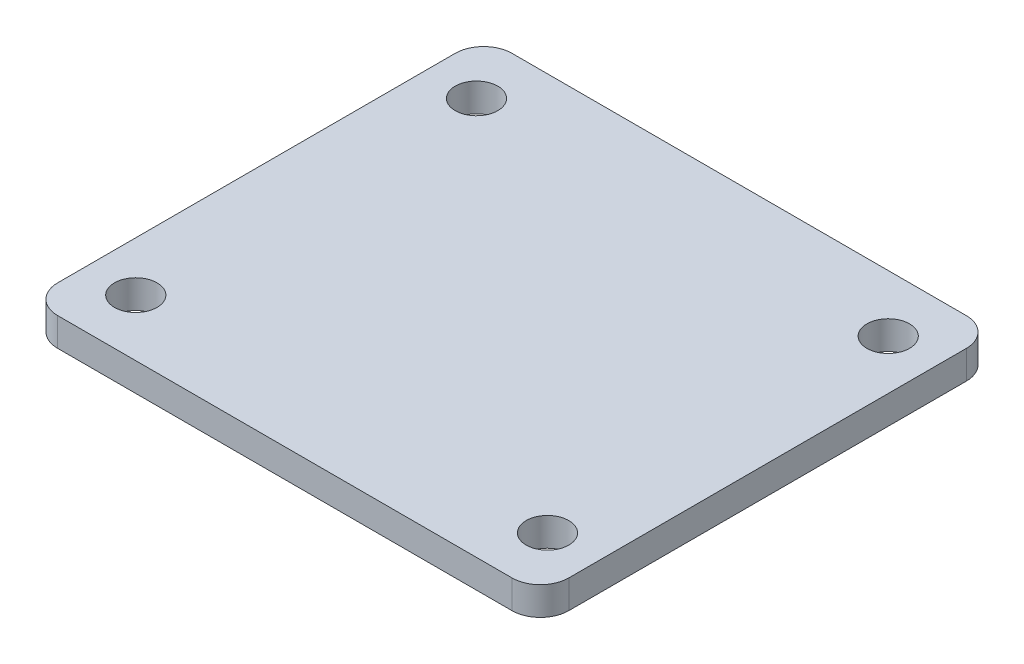
ISO-10303-21;
HEADER;
FILE_DESCRIPTION(('STEP AP214'),'2;1');
FILE_NAME('part.step','',(''),(''),'','','');
FILE_SCHEMA(('AUTOMOTIVE_DESIGN { 1 0 10303 214 1 1 1 1 }'));
ENDSEC;
DATA;
#1=APPLICATION_CONTEXT('core data for automotive mechanical design processes');
#2=APPLICATION_PROTOCOL_DEFINITION('international standard','automotive_design',2000,#1);
#3=PRODUCT_CONTEXT('',#1,'mechanical');
#4=PRODUCT('Part','Part','',(#3));
#5=PRODUCT_RELATED_PRODUCT_CATEGORY('part','',(#4));
#6=PRODUCT_DEFINITION_FORMATION('','',#4);
#7=PRODUCT_DEFINITION_CONTEXT('part definition',#1,'design');
#8=PRODUCT_DEFINITION('design','',#6,#7);
#9=PRODUCT_DEFINITION_SHAPE('','',#8);
#10=(LENGTH_UNIT() NAMED_UNIT(*) SI_UNIT(.MILLI.,.METRE.));
#11=(NAMED_UNIT(*) PLANE_ANGLE_UNIT() SI_UNIT($,.RADIAN.));
#12=(NAMED_UNIT(*) SI_UNIT($,.STERADIAN.) SOLID_ANGLE_UNIT());
#13=UNCERTAINTY_MEASURE_WITH_UNIT(LENGTH_MEASURE(1.E-05),#10,'distance_accuracy_value','');
#14=(GEOMETRIC_REPRESENTATION_CONTEXT(3) GLOBAL_UNCERTAINTY_ASSIGNED_CONTEXT((#13)) GLOBAL_UNIT_ASSIGNED_CONTEXT((#10,
#11,#12)) REPRESENTATION_CONTEXT('',''));
#15=CARTESIAN_POINT('',(0.,0.,0.));
#16=DIRECTION('',(0.,0.,1.));
#17=DIRECTION('',(1.,0.,0.));
#18=AXIS2_PLACEMENT_3D('',#15,#16,#17);
#19=CARTESIAN_POINT('',(-57.15,6.35,-50.8));
#20=DIRECTION('',(1.,0.,0.));
#21=DIRECTION('',(0.,0.,-1.));
#22=AXIS2_PLACEMENT_3D('',#19,#20,#21);
#23=PLANE('',#22);
#24=DIRECTION('',(0.,0.,1.));
#25=VECTOR('',#24,1.);
#26=CARTESIAN_POINT('',(-57.15,6.35,-50.8));
#27=LINE('',#26,#25);
#28=CARTESIAN_POINT('',(-57.15,6.35,-44.45));
#29=VERTEX_POINT('',#28);
#30=CARTESIAN_POINT('',(-57.15,6.35,44.45));
#31=VERTEX_POINT('',#30);
#32=EDGE_CURVE('E129',#29,#31,#27,.T.);
#33=ORIENTED_EDGE('',*,*,#32,.F.);
#34=DIRECTION('',(0.,-1.,0.));
#35=VECTOR('',#34,1.);
#36=CARTESIAN_POINT('',(-57.15,6.35,-44.45));
#37=LINE('',#36,#35);
#38=CARTESIAN_POINT('',(-57.15,0.,-44.45));
#39=VERTEX_POINT('',#38);
#40=EDGE_CURVE('E155',#29,#39,#37,.T.);
#41=ORIENTED_EDGE('',*,*,#40,.T.);
#42=DIRECTION('',(0.,0.,1.));
#43=VECTOR('',#42,1.);
#44=CARTESIAN_POINT('',(-57.15,0.,-50.8));
#45=LINE('',#44,#43);
#46=CARTESIAN_POINT('',(-57.15,0.,44.45));
#47=VERTEX_POINT('',#46);
#48=EDGE_CURVE('E161',#39,#47,#45,.T.);
#49=ORIENTED_EDGE('',*,*,#48,.T.);
#50=DIRECTION('',(0.,-1.,0.));
#51=VECTOR('',#50,1.);
#52=CARTESIAN_POINT('',(-57.15,6.35,44.45));
#53=LINE('',#52,#51);
#54=EDGE_CURVE('E153',#47,#31,#53,.F.);
#55=ORIENTED_EDGE('',*,*,#54,.T.);
#56=EDGE_LOOP('',(#33,#41,#49,#55));
#57=FACE_BOUND('',#56,.T.);
#58=ADVANCED_FACE('F37',(#57),#23,.F.);
#59=CARTESIAN_POINT('',(57.15,6.35,50.8));
#60=DIRECTION('',(0.,0.,-1.));
#61=DIRECTION('',(-1.,0.,0.));
#62=AXIS2_PLACEMENT_3D('',#59,#60,#61);
#63=PLANE('',#62);
#64=DIRECTION('',(1.,0.,0.));
#65=VECTOR('',#64,1.);
#66=CARTESIAN_POINT('',(57.15,6.35,50.8));
#67=LINE('',#66,#65);
#68=CARTESIAN_POINT('',(-50.8,6.35,50.8));
#69=VERTEX_POINT('',#68);
#70=CARTESIAN_POINT('',(50.8,6.35,50.8));
#71=VERTEX_POINT('',#70);
#72=EDGE_CURVE('E132',#69,#71,#67,.T.);
#73=ORIENTED_EDGE('',*,*,#72,.F.);
#74=DIRECTION('',(0.,-1.,0.));
#75=VECTOR('',#74,1.);
#76=CARTESIAN_POINT('',(-50.8,6.35,50.8));
#77=LINE('',#76,#75);
#78=CARTESIAN_POINT('',(-50.8,0.,50.8));
#79=VERTEX_POINT('',#78);
#80=EDGE_CURVE('E11',#69,#79,#77,.T.);
#81=ORIENTED_EDGE('',*,*,#80,.T.);
#82=DIRECTION('',(1.,0.,0.));
#83=VECTOR('',#82,1.);
#84=CARTESIAN_POINT('',(57.15,0.,50.8));
#85=LINE('',#84,#83);
#86=CARTESIAN_POINT('',(50.8,0.,50.8));
#87=VERTEX_POINT('',#86);
#88=EDGE_CURVE('E134',#79,#87,#85,.T.);
#89=ORIENTED_EDGE('',*,*,#88,.T.);
#90=DIRECTION('',(0.,-1.,0.));
#91=VECTOR('',#90,1.);
#92=CARTESIAN_POINT('',(50.8,6.35,50.8));
#93=LINE('',#92,#91);
#94=EDGE_CURVE('E45',#87,#71,#93,.F.);
#95=ORIENTED_EDGE('',*,*,#94,.T.);
#96=EDGE_LOOP('',(#73,#81,#89,#95));
#97=FACE_BOUND('',#96,.T.);
#98=ADVANCED_FACE('F215',(#97),#63,.F.);
#99=CARTESIAN_POINT('',(57.15,6.35,-50.8));
#100=DIRECTION('',(-1.,0.,0.));
#101=DIRECTION('',(0.,0.,1.));
#102=AXIS2_PLACEMENT_3D('',#99,#100,#101);
#103=PLANE('',#102);
#104=DIRECTION('',(0.,0.,-1.));
#105=VECTOR('',#104,1.);
#106=CARTESIAN_POINT('',(57.15,0.,-50.8));
#107=LINE('',#106,#105);
#108=CARTESIAN_POINT('',(57.15,0.,44.45));
#109=VERTEX_POINT('',#108);
#110=CARTESIAN_POINT('',(57.15,0.,-44.45));
#111=VERTEX_POINT('',#110);
#112=EDGE_CURVE('E130',#109,#111,#107,.T.);
#113=ORIENTED_EDGE('',*,*,#112,.T.);
#114=DIRECTION('',(0.,-1.,0.));
#115=VECTOR('',#114,1.);
#116=CARTESIAN_POINT('',(57.15,6.35,-44.45));
#117=LINE('',#116,#115);
#118=CARTESIAN_POINT('',(57.15,6.35,-44.45));
#119=VERTEX_POINT('',#118);
#120=EDGE_CURVE('E108',#111,#119,#117,.F.);
#121=ORIENTED_EDGE('',*,*,#120,.T.);
#122=DIRECTION('',(0.,0.,-1.));
#123=VECTOR('',#122,1.);
#124=CARTESIAN_POINT('',(57.15,6.35,-50.8));
#125=LINE('',#124,#123);
#126=CARTESIAN_POINT('',(57.15,6.35,44.45));
#127=VERTEX_POINT('',#126);
#128=EDGE_CURVE('E173',#127,#119,#125,.T.);
#129=ORIENTED_EDGE('',*,*,#128,.F.);
#130=DIRECTION('',(0.,-1.,0.));
#131=VECTOR('',#130,1.);
#132=CARTESIAN_POINT('',(57.15,6.35,44.45));
#133=LINE('',#132,#131);
#134=EDGE_CURVE('E113',#127,#109,#133,.T.);
#135=ORIENTED_EDGE('',*,*,#134,.T.);
#136=EDGE_LOOP('',(#113,#121,#129,#135));
#137=FACE_BOUND('',#136,.T.);
#138=ADVANCED_FACE('F213',(#137),#103,.F.);
#139=CARTESIAN_POINT('',(57.15,6.35,-50.8));
#140=DIRECTION('',(0.,0.,1.));
#141=DIRECTION('',(1.,0.,0.));
#142=AXIS2_PLACEMENT_3D('',#139,#140,#141);
#143=PLANE('',#142);
#144=DIRECTION('',(-1.,0.,0.));
#145=VECTOR('',#144,1.);
#146=CARTESIAN_POINT('',(57.15,6.35,-50.8));
#147=LINE('',#146,#145);
#148=CARTESIAN_POINT('',(50.8,6.35,-50.8));
#149=VERTEX_POINT('',#148);
#150=CARTESIAN_POINT('',(-50.8,6.35,-50.8));
#151=VERTEX_POINT('',#150);
#152=EDGE_CURVE('E123',#149,#151,#147,.T.);
#153=ORIENTED_EDGE('',*,*,#152,.F.);
#154=DIRECTION('',(0.,-1.,0.));
#155=VECTOR('',#154,1.);
#156=CARTESIAN_POINT('',(50.8,6.35,-50.8));
#157=LINE('',#156,#155);
#158=CARTESIAN_POINT('',(50.8,0.,-50.8));
#159=VERTEX_POINT('',#158);
#160=EDGE_CURVE('E107',#149,#159,#157,.T.);
#161=ORIENTED_EDGE('',*,*,#160,.T.);
#162=DIRECTION('',(-1.,0.,0.));
#163=VECTOR('',#162,1.);
#164=CARTESIAN_POINT('',(57.15,0.,-50.8));
#165=LINE('',#164,#163);
#166=CARTESIAN_POINT('',(-50.8,0.,-50.8));
#167=VERTEX_POINT('',#166);
#168=EDGE_CURVE('E120',#159,#167,#165,.T.);
#169=ORIENTED_EDGE('',*,*,#168,.T.);
#170=DIRECTION('',(0.,-1.,0.));
#171=VECTOR('',#170,1.);
#172=CARTESIAN_POINT('',(-50.8,6.35,-50.8));
#173=LINE('',#172,#171);
#174=EDGE_CURVE('E125',#167,#151,#173,.F.);
#175=ORIENTED_EDGE('',*,*,#174,.T.);
#176=EDGE_LOOP('',(#153,#161,#169,#175));
#177=FACE_BOUND('',#176,.T.);
#178=ADVANCED_FACE('F119',(#177),#143,.F.);
#179=CARTESIAN_POINT('',(0.,6.35,0.));
#180=DIRECTION('',(0.,-1.,0.));
#181=DIRECTION('',(0.,0.,-1.));
#182=AXIS2_PLACEMENT_3D('',#179,#180,#181);
#183=PLANE('',#182);
#184=CARTESIAN_POINT('',(46.0375,6.35,38.1));
#185=DIRECTION('',(0.,1.,0.));
#186=DIRECTION('',(0.,0.,1.));
#187=AXIS2_PLACEMENT_3D('',#184,#185,#186);
#188=CIRCLE('',#187,4.7625);
#189=CARTESIAN_POINT('',(46.0375,6.35,42.8625));
#190=VERTEX_POINT('',#189);
#191=EDGE_CURVE('E194',#190,#190,#188,.T.);
#192=ORIENTED_EDGE('',*,*,#191,.F.);
#193=EDGE_LOOP('',(#192));
#194=FACE_BOUND('',#193,.T.);
#195=CARTESIAN_POINT('',(-46.0375,6.35,38.1));
#196=DIRECTION('',(0.,1.,0.));
#197=DIRECTION('',(0.,0.,1.));
#198=AXIS2_PLACEMENT_3D('',#195,#196,#197);
#199=CIRCLE('',#198,4.7625);
#200=CARTESIAN_POINT('',(-46.0375,6.35,42.8625));
#201=VERTEX_POINT('',#200);
#202=EDGE_CURVE('E188',#201,#201,#199,.T.);
#203=ORIENTED_EDGE('',*,*,#202,.F.);
#204=EDGE_LOOP('',(#203));
#205=FACE_BOUND('',#204,.T.);
#206=CARTESIAN_POINT('',(-46.0375,6.35,-38.1));
#207=DIRECTION('',(0.,1.,0.));
#208=DIRECTION('',(0.,0.,1.));
#209=AXIS2_PLACEMENT_3D('',#206,#207,#208);
#210=CIRCLE('',#209,4.7625);
#211=CARTESIAN_POINT('',(-46.0375,6.35,-33.3375));
#212=VERTEX_POINT('',#211);
#213=EDGE_CURVE('E182',#212,#212,#210,.T.);
#214=ORIENTED_EDGE('',*,*,#213,.F.);
#215=EDGE_LOOP('',(#214));
#216=FACE_BOUND('',#215,.T.);
#217=CARTESIAN_POINT('',(46.0375,6.35,-38.1));
#218=DIRECTION('',(0.,1.,0.));
#219=DIRECTION('',(0.,0.,1.));
#220=AXIS2_PLACEMENT_3D('',#217,#218,#219);
#221=CIRCLE('',#220,4.7625);
#222=CARTESIAN_POINT('',(46.0375,6.35,-33.3375));
#223=VERTEX_POINT('',#222);
#224=EDGE_CURVE('E169',#223,#223,#221,.T.);
#225=ORIENTED_EDGE('',*,*,#224,.F.);
#226=EDGE_LOOP('',(#225));
#227=FACE_BOUND('',#226,.T.);
#228=ORIENTED_EDGE('',*,*,#128,.T.);
#229=CARTESIAN_POINT('',(50.8,6.35,-44.45));
#230=DIRECTION('',(0.,-1.,0.));
#231=DIRECTION('',(0.,0.,-1.));
#232=AXIS2_PLACEMENT_3D('',#229,#230,#231);
#233=CIRCLE('',#232,6.35);
#234=EDGE_CURVE('E151',#119,#149,#233,.F.);
#235=ORIENTED_EDGE('',*,*,#234,.T.);
#236=ORIENTED_EDGE('',*,*,#152,.T.);
#237=CARTESIAN_POINT('',(-50.8,6.35,-44.45));
#238=DIRECTION('',(0.,-1.,0.));
#239=DIRECTION('',(0.,0.,-1.));
#240=AXIS2_PLACEMENT_3D('',#237,#238,#239);
#241=CIRCLE('',#240,6.35);
#242=EDGE_CURVE('E149',#151,#29,#241,.F.);
#243=ORIENTED_EDGE('',*,*,#242,.T.);
#244=ORIENTED_EDGE('',*,*,#32,.T.);
#245=CARTESIAN_POINT('',(-50.8,6.35,44.45));
#246=DIRECTION('',(0.,-1.,0.));
#247=DIRECTION('',(0.,0.,-1.));
#248=AXIS2_PLACEMENT_3D('',#245,#246,#247);
#249=CIRCLE('',#248,6.35);
#250=EDGE_CURVE('E58',#31,#69,#249,.F.);
#251=ORIENTED_EDGE('',*,*,#250,.T.);
#252=ORIENTED_EDGE('',*,*,#72,.T.);
#253=CARTESIAN_POINT('',(50.8,6.35,44.45));
#254=DIRECTION('',(0.,-1.,0.));
#255=DIRECTION('',(0.,0.,-1.));
#256=AXIS2_PLACEMENT_3D('',#253,#254,#255);
#257=CIRCLE('',#256,6.35);
#258=EDGE_CURVE('E146',#71,#127,#257,.F.);
#259=ORIENTED_EDGE('',*,*,#258,.T.);
#260=EDGE_LOOP('',(#228,#235,#236,#243,#244,#251,#252,#259));
#261=FACE_BOUND('',#260,.T.);
#262=ADVANCED_FACE('F200',(#194,#205,#216,#227,#261),#183,.F.);
#263=CARTESIAN_POINT('',(0.,0.,0.));
#264=DIRECTION('',(0.,-1.,0.));
#265=DIRECTION('',(0.,0.,-1.));
#266=AXIS2_PLACEMENT_3D('',#263,#264,#265);
#267=PLANE('',#266);
#268=CARTESIAN_POINT('',(46.0375,0.,38.1));
#269=DIRECTION('',(0.,1.,0.));
#270=DIRECTION('',(0.,0.,1.));
#271=AXIS2_PLACEMENT_3D('',#268,#269,#270);
#272=CIRCLE('',#271,4.7625);
#273=CARTESIAN_POINT('',(46.0375,0.,42.8625));
#274=VERTEX_POINT('',#273);
#275=EDGE_CURVE('E191',#274,#274,#272,.T.);
#276=ORIENTED_EDGE('',*,*,#275,.T.);
#277=EDGE_LOOP('',(#276));
#278=FACE_BOUND('',#277,.T.);
#279=CARTESIAN_POINT('',(-46.0375,0.,38.1));
#280=DIRECTION('',(0.,1.,0.));
#281=DIRECTION('',(0.,0.,1.));
#282=AXIS2_PLACEMENT_3D('',#279,#280,#281);
#283=CIRCLE('',#282,4.7625);
#284=CARTESIAN_POINT('',(-46.0375,0.,42.8625));
#285=VERTEX_POINT('',#284);
#286=EDGE_CURVE('E185',#285,#285,#283,.T.);
#287=ORIENTED_EDGE('',*,*,#286,.T.);
#288=EDGE_LOOP('',(#287));
#289=FACE_BOUND('',#288,.T.);
#290=CARTESIAN_POINT('',(-46.0375,0.,-38.1));
#291=DIRECTION('',(0.,1.,0.));
#292=DIRECTION('',(0.,0.,1.));
#293=AXIS2_PLACEMENT_3D('',#290,#291,#292);
#294=CIRCLE('',#293,4.7625);
#295=CARTESIAN_POINT('',(-46.0375,0.,-33.3375));
#296=VERTEX_POINT('',#295);
#297=EDGE_CURVE('E179',#296,#296,#294,.T.);
#298=ORIENTED_EDGE('',*,*,#297,.T.);
#299=EDGE_LOOP('',(#298));
#300=FACE_BOUND('',#299,.T.);
#301=CARTESIAN_POINT('',(46.0375,0.,-38.1));
#302=DIRECTION('',(0.,1.,0.));
#303=DIRECTION('',(0.,0.,1.));
#304=AXIS2_PLACEMENT_3D('',#301,#302,#303);
#305=CIRCLE('',#304,4.7625);
#306=CARTESIAN_POINT('',(46.0375,0.,-33.3375));
#307=VERTEX_POINT('',#306);
#308=EDGE_CURVE('E166',#307,#307,#305,.T.);
#309=ORIENTED_EDGE('',*,*,#308,.T.);
#310=EDGE_LOOP('',(#309));
#311=FACE_BOUND('',#310,.T.);
#312=ORIENTED_EDGE('',*,*,#168,.F.);
#313=CARTESIAN_POINT('',(50.8,0.,-44.45));
#314=DIRECTION('',(0.,-1.,0.));
#315=DIRECTION('',(0.,0.,-1.));
#316=AXIS2_PLACEMENT_3D('',#313,#314,#315);
#317=CIRCLE('',#316,6.35);
#318=EDGE_CURVE('E103',#159,#111,#317,.T.);
#319=ORIENTED_EDGE('',*,*,#318,.T.);
#320=ORIENTED_EDGE('',*,*,#112,.F.);
#321=CARTESIAN_POINT('',(50.8,0.,44.45));
#322=DIRECTION('',(0.,-1.,0.));
#323=DIRECTION('',(0.,0.,-1.));
#324=AXIS2_PLACEMENT_3D('',#321,#322,#323);
#325=CIRCLE('',#324,6.35);
#326=EDGE_CURVE('E124',#109,#87,#325,.T.);
#327=ORIENTED_EDGE('',*,*,#326,.T.);
#328=ORIENTED_EDGE('',*,*,#88,.F.);
#329=CARTESIAN_POINT('',(-50.8,0.,44.45));
#330=DIRECTION('',(0.,-1.,0.));
#331=DIRECTION('',(0.,0.,-1.));
#332=AXIS2_PLACEMENT_3D('',#329,#330,#331);
#333=CIRCLE('',#332,6.35);
#334=EDGE_CURVE('E140',#79,#47,#333,.T.);
#335=ORIENTED_EDGE('',*,*,#334,.T.);
#336=ORIENTED_EDGE('',*,*,#48,.F.);
#337=CARTESIAN_POINT('',(-50.8,0.,-44.45));
#338=DIRECTION('',(0.,-1.,0.));
#339=DIRECTION('',(0.,0.,-1.));
#340=AXIS2_PLACEMENT_3D('',#337,#338,#339);
#341=CIRCLE('',#340,6.35);
#342=EDGE_CURVE('E114',#39,#167,#341,.T.);
#343=ORIENTED_EDGE('',*,*,#342,.T.);
#344=EDGE_LOOP('',(#312,#319,#320,#327,#328,#335,#336,#343));
#345=FACE_BOUND('',#344,.T.);
#346=ADVANCED_FACE('F127',(#278,#289,#300,#311,#345),#267,.T.);
#347=CARTESIAN_POINT('',(50.8,6.35,-44.45));
#348=DIRECTION('',(0.,-1.,0.));
#349=DIRECTION('',(0.,0.,-1.));
#350=AXIS2_PLACEMENT_3D('',#347,#348,#349);
#351=CYLINDRICAL_SURFACE('',#350,6.35);
#352=ORIENTED_EDGE('',*,*,#234,.F.);
#353=ORIENTED_EDGE('',*,*,#120,.F.);
#354=ORIENTED_EDGE('',*,*,#318,.F.);
#355=ORIENTED_EDGE('',*,*,#160,.F.);
#356=EDGE_LOOP('',(#352,#353,#354,#355));
#357=FACE_BOUND('',#356,.T.);
#358=ADVANCED_FACE('F106',(#357),#351,.T.);
#359=CARTESIAN_POINT('',(-50.8,6.35,-44.45));
#360=DIRECTION('',(0.,-1.,0.));
#361=DIRECTION('',(0.,0.,-1.));
#362=AXIS2_PLACEMENT_3D('',#359,#360,#361);
#363=CYLINDRICAL_SURFACE('',#362,6.35);
#364=ORIENTED_EDGE('',*,*,#242,.F.);
#365=ORIENTED_EDGE('',*,*,#174,.F.);
#366=ORIENTED_EDGE('',*,*,#342,.F.);
#367=ORIENTED_EDGE('',*,*,#40,.F.);
#368=EDGE_LOOP('',(#364,#365,#366,#367));
#369=FACE_BOUND('',#368,.T.);
#370=ADVANCED_FACE('F219',(#369),#363,.T.);
#371=CARTESIAN_POINT('',(-50.8,6.35,44.45));
#372=DIRECTION('',(0.,-1.,0.));
#373=DIRECTION('',(0.,0.,-1.));
#374=AXIS2_PLACEMENT_3D('',#371,#372,#373);
#375=CYLINDRICAL_SURFACE('',#374,6.35);
#376=ORIENTED_EDGE('',*,*,#250,.F.);
#377=ORIENTED_EDGE('',*,*,#54,.F.);
#378=ORIENTED_EDGE('',*,*,#334,.F.);
#379=ORIENTED_EDGE('',*,*,#80,.F.);
#380=EDGE_LOOP('',(#376,#377,#378,#379));
#381=FACE_BOUND('',#380,.T.);
#382=ADVANCED_FACE('F218',(#381),#375,.T.);
#383=CARTESIAN_POINT('',(50.8,6.35,44.45));
#384=DIRECTION('',(0.,-1.,0.));
#385=DIRECTION('',(0.,0.,-1.));
#386=AXIS2_PLACEMENT_3D('',#383,#384,#385);
#387=CYLINDRICAL_SURFACE('',#386,6.35);
#388=ORIENTED_EDGE('',*,*,#258,.F.);
#389=ORIENTED_EDGE('',*,*,#94,.F.);
#390=ORIENTED_EDGE('',*,*,#326,.F.);
#391=ORIENTED_EDGE('',*,*,#134,.F.);
#392=EDGE_LOOP('',(#388,#389,#390,#391));
#393=FACE_BOUND('',#392,.T.);
#394=ADVANCED_FACE('F39',(#393),#387,.T.);
#395=CARTESIAN_POINT('',(46.0375,6.35,-38.1));
#396=DIRECTION('',(0.,1.,0.));
#397=DIRECTION('',(0.,0.,1.));
#398=AXIS2_PLACEMENT_3D('',#395,#396,#397);
#399=CYLINDRICAL_SURFACE('',#398,4.7625);
#400=ORIENTED_EDGE('',*,*,#308,.F.);
#401=EDGE_LOOP('',(#400));
#402=FACE_BOUND('',#401,.T.);
#403=ORIENTED_EDGE('',*,*,#224,.T.);
#404=EDGE_LOOP('',(#403));
#405=FACE_BOUND('',#404,.T.);
#406=ADVANCED_FACE('F241',(#402,#405),#399,.F.);
#407=CARTESIAN_POINT('',(-46.0375,6.35,-38.1));
#408=DIRECTION('',(0.,1.,0.));
#409=DIRECTION('',(0.,0.,1.));
#410=AXIS2_PLACEMENT_3D('',#407,#408,#409);
#411=CYLINDRICAL_SURFACE('',#410,4.7625);
#412=ORIENTED_EDGE('',*,*,#297,.F.);
#413=EDGE_LOOP('',(#412));
#414=FACE_BOUND('',#413,.T.);
#415=ORIENTED_EDGE('',*,*,#213,.T.);
#416=EDGE_LOOP('',(#415));
#417=FACE_BOUND('',#416,.T.);
#418=ADVANCED_FACE('F244',(#414,#417),#411,.F.);
#419=CARTESIAN_POINT('',(-46.0375,6.35,38.1));
#420=DIRECTION('',(0.,1.,0.));
#421=DIRECTION('',(0.,0.,1.));
#422=AXIS2_PLACEMENT_3D('',#419,#420,#421);
#423=CYLINDRICAL_SURFACE('',#422,4.7625);
#424=ORIENTED_EDGE('',*,*,#286,.F.);
#425=EDGE_LOOP('',(#424));
#426=FACE_BOUND('',#425,.T.);
#427=ORIENTED_EDGE('',*,*,#202,.T.);
#428=EDGE_LOOP('',(#427));
#429=FACE_BOUND('',#428,.T.);
#430=ADVANCED_FACE('F248',(#426,#429),#423,.F.);
#431=CARTESIAN_POINT('',(46.0375,6.35,38.1));
#432=DIRECTION('',(0.,1.,0.));
#433=DIRECTION('',(0.,0.,1.));
#434=AXIS2_PLACEMENT_3D('',#431,#432,#433);
#435=CYLINDRICAL_SURFACE('',#434,4.7625);
#436=ORIENTED_EDGE('',*,*,#275,.F.);
#437=EDGE_LOOP('',(#436));
#438=FACE_BOUND('',#437,.T.);
#439=ORIENTED_EDGE('',*,*,#191,.T.);
#440=EDGE_LOOP('',(#439));
#441=FACE_BOUND('',#440,.T.);
#442=ADVANCED_FACE('F198',(#438,#441),#435,.F.);
#443=CLOSED_SHELL('',(#58,#98,#138,#178,#262,#346,#358,#370,#382,#394,#406,#418,#430,#442));
#444=MANIFOLD_SOLID_BREP('B2',#443);
#445=ADVANCED_BREP_SHAPE_REPRESENTATION('',(#18,#444),#14);
#446=SHAPE_DEFINITION_REPRESENTATION(#9,#445);
ENDSEC;
END-ISO-10303-21;
